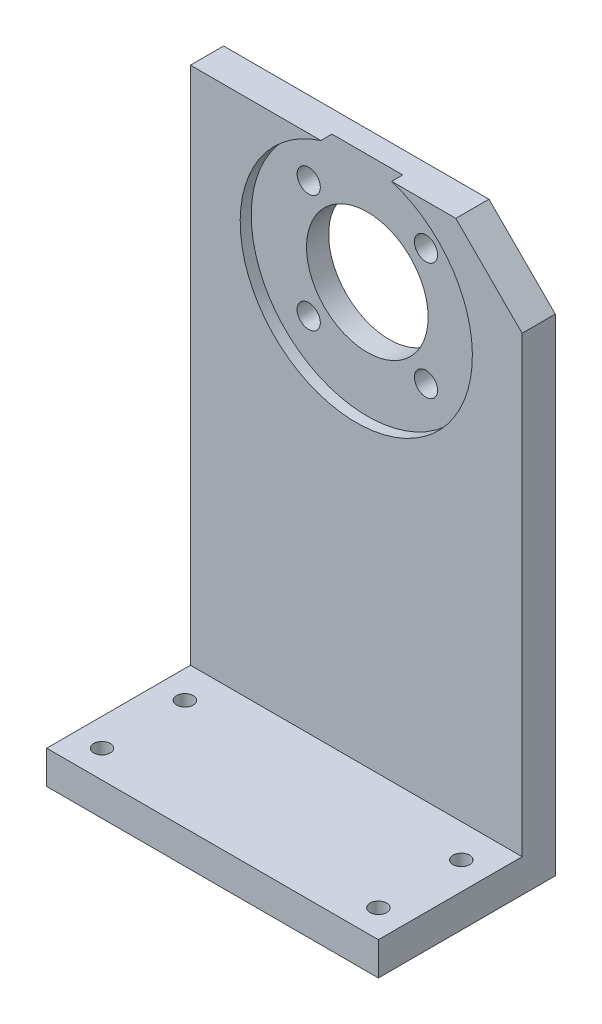
ISO-10303-21;
HEADER;
FILE_DESCRIPTION(('STEP AP214'),'2;1');
FILE_NAME('part.step','',(''),(''),'','','');
FILE_SCHEMA(('AUTOMOTIVE_DESIGN { 1 0 10303 214 1 1 1 1 }'));
ENDSEC;
DATA;
#1=APPLICATION_CONTEXT('core data for automotive mechanical design processes');
#2=APPLICATION_PROTOCOL_DEFINITION('international standard','automotive_design',2000,#1);
#3=PRODUCT_CONTEXT('',#1,'mechanical');
#4=PRODUCT('Part','Part','',(#3));
#5=PRODUCT_RELATED_PRODUCT_CATEGORY('part','',(#4));
#6=PRODUCT_DEFINITION_FORMATION('','',#4);
#7=PRODUCT_DEFINITION_CONTEXT('part definition',#1,'design');
#8=PRODUCT_DEFINITION('design','',#6,#7);
#9=PRODUCT_DEFINITION_SHAPE('','',#8);
#10=(LENGTH_UNIT() NAMED_UNIT(*) SI_UNIT(.MILLI.,.METRE.));
#11=(NAMED_UNIT(*) PLANE_ANGLE_UNIT() SI_UNIT($,.RADIAN.));
#12=(NAMED_UNIT(*) SI_UNIT($,.STERADIAN.) SOLID_ANGLE_UNIT());
#13=UNCERTAINTY_MEASURE_WITH_UNIT(LENGTH_MEASURE(1.E-05),#10,'distance_accuracy_value','');
#14=(GEOMETRIC_REPRESENTATION_CONTEXT(3) GLOBAL_UNCERTAINTY_ASSIGNED_CONTEXT((#13)) GLOBAL_UNIT_ASSIGNED_CONTEXT((#10,
#11,#12)) REPRESENTATION_CONTEXT('',''));
#15=CARTESIAN_POINT('',(0.,0.,0.));
#16=DIRECTION('',(0.,0.,1.));
#17=DIRECTION('',(1.,0.,0.));
#18=AXIS2_PLACEMENT_3D('',#15,#16,#17);
#19=CARTESIAN_POINT('',(225.596535273302,-222.754281735798,33.));
#20=DIRECTION('',(0.,0.,-1.));
#21=DIRECTION('',(-1.,0.,0.));
#22=AXIS2_PLACEMENT_3D('',#19,#20,#21);
#23=CYLINDRICAL_SURFACE('',#22,2.09999999999999);
#24=CARTESIAN_POINT('',(225.596535273302,-222.754281735798,23.8082903767918));
#25=DIRECTION('',(0.,0.,-1.));
#26=DIRECTION('',(1.,0.,0.));
#27=AXIS2_PLACEMENT_3D('',#24,#25,#26);
#28=CIRCLE('',#27,2.10000000000823);
#29=CARTESIAN_POINT('',(227.69653527331,-222.754281735798,23.8082903767918));
#30=VERTEX_POINT('',#29);
#31=EDGE_CURVE('E166',#30,#30,#28,.T.);
#32=ORIENTED_EDGE('',*,*,#31,.T.);
#33=EDGE_LOOP('',(#32));
#34=FACE_BOUND('',#33,.T.);
#35=CARTESIAN_POINT('',(225.596535273302,-222.754281735798,27.));
#36=DIRECTION('',(0.,0.,-1.));
#37=DIRECTION('',(-1.,0.,0.));
#38=AXIS2_PLACEMENT_3D('',#35,#36,#37);
#39=CIRCLE('',#38,2.09999999999999);
#40=CARTESIAN_POINT('',(223.496535273302,-222.754281735798,27.));
#41=VERTEX_POINT('',#40);
#42=EDGE_CURVE('E84',#41,#41,#39,.T.);
#43=ORIENTED_EDGE('',*,*,#42,.F.);
#44=EDGE_LOOP('',(#43));
#45=FACE_BOUND('',#44,.T.);
#46=ADVANCED_FACE('F17',(#34,#45),#23,.F.);
#47=CARTESIAN_POINT('',(246.809738708898,-201.541078300202,33.));
#48=DIRECTION('',(0.,0.,-1.));
#49=DIRECTION('',(-1.,0.,0.));
#50=AXIS2_PLACEMENT_3D('',#47,#48,#49);
#51=CYLINDRICAL_SURFACE('',#50,2.09999999999999);
#52=CARTESIAN_POINT('',(246.809738708898,-201.541078300202,27.));
#53=DIRECTION('',(0.,0.,-1.));
#54=DIRECTION('',(-1.,0.,0.));
#55=AXIS2_PLACEMENT_3D('',#52,#53,#54);
#56=CIRCLE('',#55,2.09999999999999);
#57=CARTESIAN_POINT('',(244.709738708898,-201.541078300202,27.));
#58=VERTEX_POINT('',#57);
#59=EDGE_CURVE('E205',#58,#58,#56,.T.);
#60=ORIENTED_EDGE('',*,*,#59,.F.);
#61=EDGE_LOOP('',(#60));
#62=FACE_BOUND('',#61,.T.);
#63=CARTESIAN_POINT('',(246.809738708898,-201.541078300202,23.8082903768486));
#64=DIRECTION('',(0.,0.,-1.));
#65=DIRECTION('',(-1.,0.,0.));
#66=AXIS2_PLACEMENT_3D('',#63,#64,#65);
#67=CIRCLE('',#66,2.09999999996388);
#68=CARTESIAN_POINT('',(244.709738708934,-201.541078300202,23.8082903768486));
#69=VERTEX_POINT('',#68);
#70=EDGE_CURVE('E163',#69,#69,#67,.T.);
#71=ORIENTED_EDGE('',*,*,#70,.T.);
#72=EDGE_LOOP('',(#71));
#73=FACE_BOUND('',#72,.T.);
#74=ADVANCED_FACE('F226',(#62,#73),#51,.F.);
#75=CARTESIAN_POINT('',(211.2030482675,-297.147680018,50.));
#76=DIRECTION('',(0.,1.,0.));
#77=DIRECTION('',(0.,0.,1.));
#78=AXIS2_PLACEMENT_3D('',#75,#76,#77);
#79=CYLINDRICAL_SURFACE('',#78,1.50000000000003);
#80=CARTESIAN_POINT('',(211.2030482675,-292.147680018,50.));
#81=DIRECTION('',(0.,1.,0.));
#82=DIRECTION('',(0.,0.,1.));
#83=AXIS2_PLACEMENT_3D('',#80,#81,#82);
#84=CIRCLE('',#83,1.50000000000003);
#85=CARTESIAN_POINT('',(211.2030482675,-292.147680018,51.5));
#86=VERTEX_POINT('',#85);
#87=EDGE_CURVE('E193',#86,#86,#84,.T.);
#88=ORIENTED_EDGE('',*,*,#87,.F.);
#89=EDGE_LOOP('',(#88));
#90=FACE_BOUND('',#89,.T.);
#91=CARTESIAN_POINT('',(211.2030482675,-286.147680018,50.));
#92=DIRECTION('',(0.,1.,0.));
#93=DIRECTION('',(0.,0.,1.));
#94=AXIS2_PLACEMENT_3D('',#91,#92,#93);
#95=CIRCLE('',#94,1.50000000000003);
#96=CARTESIAN_POINT('',(211.2030482675,-286.147680018,51.5));
#97=VERTEX_POINT('',#96);
#98=EDGE_CURVE('E20',#97,#97,#95,.F.);
#99=ORIENTED_EDGE('',*,*,#98,.F.);
#100=EDGE_LOOP('',(#99));
#101=FACE_BOUND('',#100,.T.);
#102=ADVANCED_FACE('F223',(#90,#101),#79,.F.);
#103=CARTESIAN_POINT('',(211.2030482675,-297.147680018,35.));
#104=DIRECTION('',(0.,1.,0.));
#105=DIRECTION('',(0.,0.,1.));
#106=AXIS2_PLACEMENT_3D('',#103,#104,#105);
#107=CYLINDRICAL_SURFACE('',#106,1.50000000000003);
#108=CARTESIAN_POINT('',(211.2030482675,-292.147680018,35.));
#109=DIRECTION('',(0.,1.,0.));
#110=DIRECTION('',(0.,0.,1.));
#111=AXIS2_PLACEMENT_3D('',#108,#109,#110);
#112=CIRCLE('',#111,1.50000000000003);
#113=CARTESIAN_POINT('',(211.2030482675,-292.147680018,36.5));
#114=VERTEX_POINT('',#113);
#115=EDGE_CURVE('E190',#114,#114,#112,.T.);
#116=ORIENTED_EDGE('',*,*,#115,.F.);
#117=EDGE_LOOP('',(#116));
#118=FACE_BOUND('',#117,.T.);
#119=CARTESIAN_POINT('',(211.2030482675,-286.147680018,35.));
#120=DIRECTION('',(0.,1.,0.));
#121=DIRECTION('',(0.,0.,1.));
#122=AXIS2_PLACEMENT_3D('',#119,#120,#121);
#123=CIRCLE('',#122,1.50000000000003);
#124=CARTESIAN_POINT('',(211.2030482675,-286.147680018,36.5));
#125=VERTEX_POINT('',#124);
#126=EDGE_CURVE('E212',#125,#125,#123,.F.);
#127=ORIENTED_EDGE('',*,*,#126,.F.);
#128=EDGE_LOOP('',(#127));
#129=FACE_BOUND('',#128,.T.);
#130=ADVANCED_FACE('F225',(#118,#129),#107,.F.);
#131=CARTESIAN_POINT('',(261.2030482675,-297.147680018,35.));
#132=DIRECTION('',(0.,1.,0.));
#133=DIRECTION('',(0.,0.,1.));
#134=AXIS2_PLACEMENT_3D('',#131,#132,#133);
#135=CYLINDRICAL_SURFACE('',#134,1.50000000000002);
#136=CARTESIAN_POINT('',(261.2030482675,-292.147680018,35.));
#137=DIRECTION('',(0.,1.,0.));
#138=DIRECTION('',(0.,0.,1.));
#139=AXIS2_PLACEMENT_3D('',#136,#137,#138);
#140=CIRCLE('',#139,1.50000000000002);
#141=CARTESIAN_POINT('',(261.2030482675,-292.147680018,36.5));
#142=VERTEX_POINT('',#141);
#143=EDGE_CURVE('E187',#142,#142,#140,.T.);
#144=ORIENTED_EDGE('',*,*,#143,.F.);
#145=EDGE_LOOP('',(#144));
#146=FACE_BOUND('',#145,.T.);
#147=CARTESIAN_POINT('',(261.2030482675,-286.147680018,35.));
#148=DIRECTION('',(0.,1.,0.));
#149=DIRECTION('',(0.,0.,1.));
#150=AXIS2_PLACEMENT_3D('',#147,#148,#149);
#151=CIRCLE('',#150,1.50000000000002);
#152=CARTESIAN_POINT('',(261.2030482675,-286.147680018,36.5));
#153=VERTEX_POINT('',#152);
#154=EDGE_CURVE('E214',#153,#153,#151,.F.);
#155=ORIENTED_EDGE('',*,*,#154,.F.);
#156=EDGE_LOOP('',(#155));
#157=FACE_BOUND('',#156,.T.);
#158=ADVANCED_FACE('F234',(#146,#157),#135,.F.);
#159=CARTESIAN_POINT('',(261.2030482675,-297.147680018,50.));
#160=DIRECTION('',(0.,1.,0.));
#161=DIRECTION('',(0.,0.,1.));
#162=AXIS2_PLACEMENT_3D('',#159,#160,#161);
#163=CYLINDRICAL_SURFACE('',#162,1.50000000000002);
#164=CARTESIAN_POINT('',(261.2030482675,-292.147680018,50.));
#165=DIRECTION('',(0.,1.,0.));
#166=DIRECTION('',(0.,0.,1.));
#167=AXIS2_PLACEMENT_3D('',#164,#165,#166);
#168=CIRCLE('',#167,1.50000000000002);
#169=CARTESIAN_POINT('',(261.2030482675,-292.147680018,51.5));
#170=VERTEX_POINT('',#169);
#171=EDGE_CURVE('E183',#170,#170,#168,.T.);
#172=ORIENTED_EDGE('',*,*,#171,.F.);
#173=EDGE_LOOP('',(#172));
#174=FACE_BOUND('',#173,.T.);
#175=CARTESIAN_POINT('',(261.2030482675,-286.147680018,50.));
#176=DIRECTION('',(0.,1.,0.));
#177=DIRECTION('',(0.,0.,1.));
#178=AXIS2_PLACEMENT_3D('',#175,#176,#177);
#179=CIRCLE('',#178,1.50000000000002);
#180=CARTESIAN_POINT('',(261.2030482675,-286.147680018,51.5));
#181=VERTEX_POINT('',#180);
#182=EDGE_CURVE('E149',#181,#181,#179,.F.);
#183=ORIENTED_EDGE('',*,*,#182,.F.);
#184=EDGE_LOOP('',(#183));
#185=FACE_BOUND('',#184,.T.);
#186=ADVANCED_FACE('F308',(#174,#185),#163,.F.);
#187=CARTESIAN_POINT('',(0.,-286.147680018,0.));
#188=DIRECTION('',(0.,1.,0.));
#189=DIRECTION('',(0.,0.,1.));
#190=AXIS2_PLACEMENT_3D('',#187,#188,#189);
#191=PLANE('',#190);
#192=ORIENTED_EDGE('',*,*,#182,.T.);
#193=EDGE_LOOP('',(#192));
#194=FACE_BOUND('',#193,.T.);
#195=ORIENTED_EDGE('',*,*,#126,.T.);
#196=EDGE_LOOP('',(#195));
#197=FACE_BOUND('',#196,.T.);
#198=DIRECTION('',(0.,0.,-1.));
#199=VECTOR('',#198,1.);
#200=CARTESIAN_POINT('',(206.2030482675,-286.147680018,23.));
#201=LINE('',#200,#199);
#202=CARTESIAN_POINT('',(206.2030482675,-286.147680018,29.));
#203=VERTEX_POINT('',#202);
#204=CARTESIAN_POINT('',(206.2030482675,-286.147680018,55.));
#205=VERTEX_POINT('',#204);
#206=EDGE_CURVE('E132',#203,#205,#201,.F.);
#207=ORIENTED_EDGE('',*,*,#206,.T.);
#208=DIRECTION('',(1.,0.,0.));
#209=VECTOR('',#208,1.);
#210=CARTESIAN_POINT('',(0.,-286.147680018,55.));
#211=LINE('',#210,#209);
#212=CARTESIAN_POINT('',(266.2030482675,-286.147680018,55.));
#213=VERTEX_POINT('',#212);
#214=EDGE_CURVE('E146',#213,#205,#211,.F.);
#215=ORIENTED_EDGE('',*,*,#214,.F.);
#216=DIRECTION('',(0.,0.,-1.));
#217=VECTOR('',#216,1.);
#218=CARTESIAN_POINT('',(266.2030482675,-286.147680018,23.));
#219=LINE('',#218,#217);
#220=CARTESIAN_POINT('',(266.2030482675,-286.147680018,29.));
#221=VERTEX_POINT('',#220);
#222=EDGE_CURVE('E139',#221,#213,#219,.F.);
#223=ORIENTED_EDGE('',*,*,#222,.F.);
#224=DIRECTION('',(1.,0.,0.));
#225=VECTOR('',#224,1.);
#226=CARTESIAN_POINT('',(242.8749133092,-286.147680018,29.));
#227=LINE('',#226,#225);
#228=EDGE_CURVE('E85',#203,#221,#227,.T.);
#229=ORIENTED_EDGE('',*,*,#228,.F.);
#230=EDGE_LOOP('',(#207,#215,#223,#229));
#231=FACE_BOUND('',#230,.T.);
#232=ORIENTED_EDGE('',*,*,#154,.T.);
#233=EDGE_LOOP('',(#232));
#234=FACE_BOUND('',#233,.T.);
#235=ORIENTED_EDGE('',*,*,#98,.T.);
#236=EDGE_LOOP('',(#235));
#237=FACE_BOUND('',#236,.T.);
#238=ADVANCED_FACE('F221',(#194,#197,#231,#234,#237),#191,.T.);
#239=CARTESIAN_POINT('',(0.,0.,55.));
#240=DIRECTION('',(0.,0.,1.));
#241=DIRECTION('',(1.,0.,0.));
#242=AXIS2_PLACEMENT_3D('',#239,#240,#241);
#243=PLANE('',#242);
#244=ORIENTED_EDGE('',*,*,#214,.T.);
#245=DIRECTION('',(0.,1.,0.));
#246=VECTOR('',#245,1.);
#247=CARTESIAN_POINT('',(206.2030482675,-292.147680018,55.));
#248=LINE('',#247,#246);
#249=CARTESIAN_POINT('',(206.2030482675,-292.147680018,55.));
#250=VERTEX_POINT('',#249);
#251=EDGE_CURVE('E160',#205,#250,#248,.F.);
#252=ORIENTED_EDGE('',*,*,#251,.T.);
#253=DIRECTION('',(1.,0.,0.));
#254=VECTOR('',#253,1.);
#255=CARTESIAN_POINT('',(207.616141789,-292.147680018,55.));
#256=LINE('',#255,#254);
#257=CARTESIAN_POINT('',(266.2030482675,-292.147680018,55.));
#258=VERTEX_POINT('',#257);
#259=EDGE_CURVE('E186',#258,#250,#256,.F.);
#260=ORIENTED_EDGE('',*,*,#259,.F.);
#261=DIRECTION('',(0.,1.,0.));
#262=VECTOR('',#261,1.);
#263=CARTESIAN_POINT('',(266.2030482675,-292.147680018,55.));
#264=LINE('',#263,#262);
#265=EDGE_CURVE('E155',#213,#258,#264,.F.);
#266=ORIENTED_EDGE('',*,*,#265,.F.);
#267=EDGE_LOOP('',(#244,#252,#260,#266));
#268=FACE_BOUND('',#267,.T.);
#269=ADVANCED_FACE('F302',(#268),#243,.T.);
#270=CARTESIAN_POINT('',(242.8749133092,-210.7827941645,29.));
#271=DIRECTION('',(0.,0.,1.));
#272=DIRECTION('',(1.,0.,0.));
#273=AXIS2_PLACEMENT_3D('',#270,#271,#272);
#274=PLANE('',#273);
#275=CARTESIAN_POINT('',(236.2031369911,-212.147680018,29.));
#276=DIRECTION('',(0.,0.,1.));
#277=DIRECTION('',(1.,0.,0.));
#278=AXIS2_PLACEMENT_3D('',#275,#276,#277);
#279=CIRCLE('',#278,21.);
#280=CARTESIAN_POINT('',(242.606261228533,-192.147680018,29.));
#281=VERTEX_POINT('',#280);
#282=CARTESIAN_POINT('',(229.800012753667,-192.147680018,29.));
#283=VERTEX_POINT('',#282);
#284=EDGE_CURVE('E74',#281,#283,#279,.F.);
#285=ORIENTED_EDGE('',*,*,#284,.T.);
#286=DIRECTION('',(1.,0.,0.));
#287=VECTOR('',#286,1.);
#288=CARTESIAN_POINT('',(219.4648613036,-192.147680018,29.));
#289=LINE('',#288,#287);
#290=CARTESIAN_POINT('',(206.2030482675,-192.147680018,29.));
#291=VERTEX_POINT('',#290);
#292=EDGE_CURVE('E121',#283,#291,#289,.F.);
#293=ORIENTED_EDGE('',*,*,#292,.T.);
#294=DIRECTION('',(0.,1.,0.));
#295=VECTOR('',#294,1.);
#296=CARTESIAN_POINT('',(206.2030482675,-292.147680018,29.));
#297=LINE('',#296,#295);
#298=EDGE_CURVE('E129',#291,#203,#297,.F.);
#299=ORIENTED_EDGE('',*,*,#298,.T.);
#300=ORIENTED_EDGE('',*,*,#228,.T.);
#301=DIRECTION('',(0.,1.,0.));
#302=VECTOR('',#301,1.);
#303=CARTESIAN_POINT('',(266.2030482675,-292.147680018,29.));
#304=LINE('',#303,#302);
#305=CARTESIAN_POINT('',(266.203048267483,-204.147680018004,29.));
#306=VERTEX_POINT('',#305);
#307=EDGE_CURVE('E136',#306,#221,#304,.F.);
#308=ORIENTED_EDGE('',*,*,#307,.F.);
#309=DIRECTION('',(-0.707106781186547,0.707106781186548,0.));
#310=VECTOR('',#309,1.);
#311=CARTESIAN_POINT('',(254.203048267471,-192.147680018,29.));
#312=LINE('',#311,#310);
#313=CARTESIAN_POINT('',(254.203048267471,-192.147680018,29.));
#314=VERTEX_POINT('',#313);
#315=EDGE_CURVE('E95',#314,#306,#312,.F.);
#316=ORIENTED_EDGE('',*,*,#315,.F.);
#317=DIRECTION('',(1.,0.,0.));
#318=VECTOR('',#317,1.);
#319=CARTESIAN_POINT('',(219.4648613036,-192.147680018,29.));
#320=LINE('',#319,#318);
#321=EDGE_CURVE('E89',#314,#281,#320,.F.);
#322=ORIENTED_EDGE('',*,*,#321,.T.);
#323=EDGE_LOOP('',(#285,#293,#299,#300,#308,#316,#322));
#324=FACE_BOUND('',#323,.T.);
#325=ADVANCED_FACE('F93',(#324),#274,.T.);
#326=CARTESIAN_POINT('',(236.2031369911,-212.147680018,27.));
#327=DIRECTION('',(0.,0.,1.));
#328=DIRECTION('',(1.,0.,0.));
#329=AXIS2_PLACEMENT_3D('',#326,#327,#328);
#330=CYLINDRICAL_SURFACE('',#329,21.);
#331=CARTESIAN_POINT('',(236.2031369911,-212.147680018,27.));
#332=DIRECTION('',(0.,0.,1.));
#333=DIRECTION('',(1.,0.,0.));
#334=AXIS2_PLACEMENT_3D('',#331,#332,#333);
#335=CIRCLE('',#334,21.);
#336=CARTESIAN_POINT('',(229.800012753667,-192.147680018,27.));
#337=VERTEX_POINT('',#336);
#338=CARTESIAN_POINT('',(242.606261228533,-192.147680018,27.));
#339=VERTEX_POINT('',#338);
#340=EDGE_CURVE('E203',#337,#339,#335,.T.);
#341=ORIENTED_EDGE('',*,*,#340,.F.);
#342=DIRECTION('',(0.,0.,-1.));
#343=VECTOR('',#342,1.);
#344=CARTESIAN_POINT('',(229.800012753667,-192.147680018,18.));
#345=LINE('',#344,#343);
#346=EDGE_CURVE('E79',#337,#283,#345,.F.);
#347=ORIENTED_EDGE('',*,*,#346,.T.);
#348=ORIENTED_EDGE('',*,*,#284,.F.);
#349=DIRECTION('',(0.,0.,-1.));
#350=VECTOR('',#349,1.);
#351=CARTESIAN_POINT('',(242.606261228533,-192.147680018,18.));
#352=LINE('',#351,#350);
#353=EDGE_CURVE('E77',#281,#339,#352,.T.);
#354=ORIENTED_EDGE('',*,*,#353,.T.);
#355=EDGE_LOOP('',(#341,#347,#348,#354));
#356=FACE_BOUND('',#355,.T.);
#357=ADVANCED_FACE('F76',(#356),#330,.F.);
#358=CARTESIAN_POINT('',(236.2031369911,-212.147680018,27.));
#359=DIRECTION('',(0.,0.,1.));
#360=DIRECTION('',(1.,0.,0.));
#361=AXIS2_PLACEMENT_3D('',#358,#359,#360);
#362=PLANE('',#361);
#363=CARTESIAN_POINT('',(246.809738708898,-222.754281735798,27.));
#364=DIRECTION('',(0.,0.,-1.));
#365=DIRECTION('',(-1.,0.,0.));
#366=AXIS2_PLACEMENT_3D('',#363,#364,#365);
#367=CIRCLE('',#366,2.09999999999999);
#368=CARTESIAN_POINT('',(244.709738708898,-222.754281735798,27.));
#369=VERTEX_POINT('',#368);
#370=EDGE_CURVE('E168',#369,#369,#367,.T.);
#371=ORIENTED_EDGE('',*,*,#370,.T.);
#372=EDGE_LOOP('',(#371));
#373=FACE_BOUND('',#372,.T.);
#374=CARTESIAN_POINT('',(225.596535273302,-201.541078300202,27.));
#375=DIRECTION('',(0.,0.,-1.));
#376=DIRECTION('',(-1.,0.,0.));
#377=AXIS2_PLACEMENT_3D('',#374,#375,#376);
#378=CIRCLE('',#377,2.09999999999999);
#379=CARTESIAN_POINT('',(223.496535273302,-201.541078300202,27.));
#380=VERTEX_POINT('',#379);
#381=EDGE_CURVE('E200',#380,#380,#378,.T.);
#382=ORIENTED_EDGE('',*,*,#381,.T.);
#383=EDGE_LOOP('',(#382));
#384=FACE_BOUND('',#383,.T.);
#385=CARTESIAN_POINT('',(236.2031369911,-212.147680018,27.));
#386=DIRECTION('',(0.,0.,1.));
#387=DIRECTION('',(1.,0.,0.));
#388=AXIS2_PLACEMENT_3D('',#385,#386,#387);
#389=CIRCLE('',#388,11.);
#390=CARTESIAN_POINT('',(247.2031369911,-212.147680018,27.));
#391=VERTEX_POINT('',#390);
#392=EDGE_CURVE('E133',#391,#391,#389,.F.);
#393=ORIENTED_EDGE('',*,*,#392,.T.);
#394=EDGE_LOOP('',(#393));
#395=FACE_BOUND('',#394,.T.);
#396=DIRECTION('',(1.,0.,0.));
#397=VECTOR('',#396,1.);
#398=CARTESIAN_POINT('',(219.4648613036,-192.147680018,27.));
#399=LINE('',#398,#397);
#400=EDGE_CURVE('E91',#339,#337,#399,.F.);
#401=ORIENTED_EDGE('',*,*,#400,.T.);
#402=ORIENTED_EDGE('',*,*,#340,.T.);
#403=EDGE_LOOP('',(#401,#402));
#404=FACE_BOUND('',#403,.T.);
#405=ORIENTED_EDGE('',*,*,#59,.T.);
#406=EDGE_LOOP('',(#405));
#407=FACE_BOUND('',#406,.T.);
#408=ORIENTED_EDGE('',*,*,#42,.T.);
#409=EDGE_LOOP('',(#408));
#410=FACE_BOUND('',#409,.T.);
#411=ADVANCED_FACE('F293',(#373,#384,#395,#404,#407,#410),#362,.T.);
#412=CARTESIAN_POINT('',(225.596535273302,-201.541078300202,33.));
#413=DIRECTION('',(0.,0.,-1.));
#414=DIRECTION('',(-1.,0.,0.));
#415=AXIS2_PLACEMENT_3D('',#412,#413,#414);
#416=CYLINDRICAL_SURFACE('',#415,2.09999999999999);
#417=ORIENTED_EDGE('',*,*,#381,.F.);
#418=EDGE_LOOP('',(#417));
#419=FACE_BOUND('',#418,.T.);
#420=CARTESIAN_POINT('',(225.596535273302,-201.541078300202,23.8082903768486));
#421=DIRECTION('',(0.,0.,-1.));
#422=DIRECTION('',(0.,-1.,0.));
#423=AXIS2_PLACEMENT_3D('',#420,#421,#422);
#424=CIRCLE('',#423,2.10000000002061);
#425=CARTESIAN_POINT('',(225.596535273302,-203.641078300222,23.8082903768486));
#426=VERTEX_POINT('',#425);
#427=EDGE_CURVE('E361',#426,#426,#424,.T.);
#428=ORIENTED_EDGE('',*,*,#427,.T.);
#429=EDGE_LOOP('',(#428));
#430=FACE_BOUND('',#429,.T.);
#431=ADVANCED_FACE('F289',(#419,#430),#416,.F.);
#432=CARTESIAN_POINT('',(246.809738708898,-222.754281735798,33.));
#433=DIRECTION('',(0.,0.,-1.));
#434=DIRECTION('',(-1.,0.,0.));
#435=AXIS2_PLACEMENT_3D('',#432,#433,#434);
#436=CYLINDRICAL_SURFACE('',#435,2.09999999999999);
#437=CARTESIAN_POINT('',(246.809738708898,-222.754281735798,23.8082903768486));
#438=DIRECTION('',(0.,0.,-1.));
#439=DIRECTION('',(0.,1.,0.));
#440=AXIS2_PLACEMENT_3D('',#437,#438,#439);
#441=CIRCLE('',#440,2.10000000000815);
#442=CARTESIAN_POINT('',(246.809738708898,-220.65428173579,23.8082903768486));
#443=VERTEX_POINT('',#442);
#444=EDGE_CURVE('E182',#443,#443,#441,.T.);
#445=ORIENTED_EDGE('',*,*,#444,.T.);
#446=EDGE_LOOP('',(#445));
#447=FACE_BOUND('',#446,.T.);
#448=ORIENTED_EDGE('',*,*,#370,.F.);
#449=EDGE_LOOP('',(#448));
#450=FACE_BOUND('',#449,.T.);
#451=ADVANCED_FACE('F285',(#447,#450),#436,.F.);
#452=CARTESIAN_POINT('',(225.596535273302,-222.754281735798,23.0000000000814));
#453=DIRECTION('',(0.,0.,-1.));
#454=DIRECTION('',(-1.,0.,0.));
#455=AXIS2_PLACEMENT_3D('',#452,#453,#454);
#456=CONICAL_SURFACE('',#455,3.49999999977049,1.047197551198);
#457=ORIENTED_EDGE('',*,*,#31,.F.);
#458=EDGE_LOOP('',(#457));
#459=FACE_BOUND('',#458,.T.);
#460=CARTESIAN_POINT('',(225.596535273302,-222.754281735798,22.9999999999967));
#461=DIRECTION('',(0.,0.,-1.));
#462=DIRECTION('',(-1.,0.,0.));
#463=AXIS2_PLACEMENT_3D('',#460,#461,#462);
#464=CIRCLE('',#463,3.49999999991724);
#465=CARTESIAN_POINT('',(222.096535273385,-222.754281735798,22.9999999999967));
#466=VERTEX_POINT('',#465);
#467=EDGE_CURVE('E179',#466,#466,#464,.T.);
#468=ORIENTED_EDGE('',*,*,#467,.T.);
#469=EDGE_LOOP('',(#468));
#470=FACE_BOUND('',#469,.T.);
#471=ADVANCED_FACE('F281',(#459,#470),#456,.F.);
#472=CARTESIAN_POINT('',(246.809738708898,-201.541078300202,23.0000000000814));
#473=DIRECTION('',(0.,0.,-1.));
#474=DIRECTION('',(-1.,0.,0.));
#475=AXIS2_PLACEMENT_3D('',#472,#473,#474);
#476=CONICAL_SURFACE('',#475,3.49999999983983,1.04719755120742);
#477=ORIENTED_EDGE('',*,*,#70,.F.);
#478=EDGE_LOOP('',(#477));
#479=FACE_BOUND('',#478,.T.);
#480=CARTESIAN_POINT('',(246.809738708898,-201.541078300202,22.9999999999711));
#481=DIRECTION('',(0.,0.,-1.));
#482=DIRECTION('',(-1.,0.,0.));
#483=AXIS2_PLACEMENT_3D('',#480,#481,#482);
#484=CIRCLE('',#483,3.50000000003092);
#485=CARTESIAN_POINT('',(243.309738708867,-201.541078300202,22.9999999999711));
#486=VERTEX_POINT('',#485);
#487=EDGE_CURVE('E176',#486,#486,#484,.T.);
#488=ORIENTED_EDGE('',*,*,#487,.T.);
#489=EDGE_LOOP('',(#488));
#490=FACE_BOUND('',#489,.T.);
#491=ADVANCED_FACE('F277',(#479,#490),#476,.F.);
#492=CARTESIAN_POINT('',(236.2031369911,-212.147680018,18.));
#493=DIRECTION('',(0.,0.,1.));
#494=DIRECTION('',(1.,0.,0.));
#495=AXIS2_PLACEMENT_3D('',#492,#493,#494);
#496=CYLINDRICAL_SURFACE('',#495,11.);
#497=CARTESIAN_POINT('',(236.2031369911,-212.147680018,23.));
#498=DIRECTION('',(0.,0.,1.));
#499=DIRECTION('',(1.,0.,0.));
#500=AXIS2_PLACEMENT_3D('',#497,#498,#499);
#501=CIRCLE('',#500,11.);
#502=CARTESIAN_POINT('',(247.2031369911,-212.147680018,23.));
#503=VERTEX_POINT('',#502);
#504=EDGE_CURVE('E172',#503,#503,#501,.F.);
#505=ORIENTED_EDGE('',*,*,#504,.T.);
#506=EDGE_LOOP('',(#505));
#507=FACE_BOUND('',#506,.T.);
#508=ORIENTED_EDGE('',*,*,#392,.F.);
#509=EDGE_LOOP('',(#508));
#510=FACE_BOUND('',#509,.T.);
#511=ADVANCED_FACE('F273',(#507,#510),#496,.F.);
#512=CARTESIAN_POINT('',(206.2030482675,-292.147680018,23.));
#513=DIRECTION('',(1.,0.,0.));
#514=DIRECTION('',(0.,0.,-1.));
#515=AXIS2_PLACEMENT_3D('',#512,#513,#514);
#516=PLANE('',#515);
#517=ORIENTED_EDGE('',*,*,#206,.F.);
#518=ORIENTED_EDGE('',*,*,#298,.F.);
#519=DIRECTION('',(0.,0.,-1.));
#520=VECTOR('',#519,1.);
#521=CARTESIAN_POINT('',(206.2030482675,-192.147680018,18.));
#522=LINE('',#521,#520);
#523=CARTESIAN_POINT('',(206.2030482675,-192.147680018,23.));
#524=VERTEX_POINT('',#523);
#525=EDGE_CURVE('E97',#291,#524,#522,.T.);
#526=ORIENTED_EDGE('',*,*,#525,.T.);
#527=DIRECTION('',(0.,1.,0.));
#528=VECTOR('',#527,1.);
#529=CARTESIAN_POINT('',(206.2030482675,0.,23.));
#530=LINE('',#529,#528);
#531=CARTESIAN_POINT('',(206.2030482675,-292.147680018,23.));
#532=VERTEX_POINT('',#531);
#533=EDGE_CURVE('E175',#524,#532,#530,.F.);
#534=ORIENTED_EDGE('',*,*,#533,.T.);
#535=DIRECTION('',(0.,0.,-1.));
#536=VECTOR('',#535,1.);
#537=CARTESIAN_POINT('',(206.2030482675,-292.147680018,23.));
#538=LINE('',#537,#536);
#539=EDGE_CURVE('E140',#250,#532,#538,.T.);
#540=ORIENTED_EDGE('',*,*,#539,.F.);
#541=ORIENTED_EDGE('',*,*,#251,.F.);
#542=EDGE_LOOP('',(#517,#518,#526,#534,#540,#541));
#543=FACE_BOUND('',#542,.T.);
#544=ADVANCED_FACE('F269',(#543),#516,.F.);
#545=CARTESIAN_POINT('',(207.616141789,-292.147680018,23.));
#546=DIRECTION('',(0.,-1.,0.));
#547=DIRECTION('',(0.,0.,-1.));
#548=AXIS2_PLACEMENT_3D('',#545,#546,#547);
#549=PLANE('',#548);
#550=ORIENTED_EDGE('',*,*,#259,.T.);
#551=ORIENTED_EDGE('',*,*,#539,.T.);
#552=DIRECTION('',(1.,0.,0.));
#553=VECTOR('',#552,1.);
#554=CARTESIAN_POINT('',(0.,-292.147680018,23.));
#555=LINE('',#554,#553);
#556=CARTESIAN_POINT('',(266.2030482675,-292.147680018,23.));
#557=VERTEX_POINT('',#556);
#558=EDGE_CURVE('E538',#532,#557,#555,.T.);
#559=ORIENTED_EDGE('',*,*,#558,.T.);
#560=DIRECTION('',(0.,0.,-1.));
#561=VECTOR('',#560,1.);
#562=CARTESIAN_POINT('',(266.2030482675,-292.147680018,23.));
#563=LINE('',#562,#561);
#564=EDGE_CURVE('E108',#258,#557,#563,.T.);
#565=ORIENTED_EDGE('',*,*,#564,.F.);
#566=EDGE_LOOP('',(#550,#551,#559,#565));
#567=FACE_BOUND('',#566,.T.);
#568=ORIENTED_EDGE('',*,*,#171,.T.);
#569=EDGE_LOOP('',(#568));
#570=FACE_BOUND('',#569,.T.);
#571=ORIENTED_EDGE('',*,*,#143,.T.);
#572=EDGE_LOOP('',(#571));
#573=FACE_BOUND('',#572,.T.);
#574=ORIENTED_EDGE('',*,*,#115,.T.);
#575=EDGE_LOOP('',(#574));
#576=FACE_BOUND('',#575,.T.);
#577=ORIENTED_EDGE('',*,*,#87,.T.);
#578=EDGE_LOOP('',(#577));
#579=FACE_BOUND('',#578,.T.);
#580=ADVANCED_FACE('F265',(#567,#570,#573,#576,#579),#549,.T.);
#581=CARTESIAN_POINT('',(266.2030482675,-292.147680018,23.));
#582=DIRECTION('',(1.,0.,0.));
#583=DIRECTION('',(0.,0.,-1.));
#584=AXIS2_PLACEMENT_3D('',#581,#582,#583);
#585=PLANE('',#584);
#586=ORIENTED_EDGE('',*,*,#265,.T.);
#587=ORIENTED_EDGE('',*,*,#564,.T.);
#588=DIRECTION('',(0.,1.,0.));
#589=VECTOR('',#588,1.);
#590=CARTESIAN_POINT('',(266.2030482675,0.,23.));
#591=LINE('',#590,#589);
#592=CARTESIAN_POINT('',(266.203048267494,-204.147680018023,23.));
#593=VERTEX_POINT('',#592);
#594=EDGE_CURVE('E118',#557,#593,#591,.T.);
#595=ORIENTED_EDGE('',*,*,#594,.T.);
#596=DIRECTION('',(0.,0.,1.));
#597=VECTOR('',#596,1.);
#598=CARTESIAN_POINT('',(266.203048267474,-204.147680018004,18.));
#599=LINE('',#598,#597);
#600=EDGE_CURVE('E107',#306,#593,#599,.F.);
#601=ORIENTED_EDGE('',*,*,#600,.F.);
#602=ORIENTED_EDGE('',*,*,#307,.T.);
#603=ORIENTED_EDGE('',*,*,#222,.T.);
#604=EDGE_LOOP('',(#586,#587,#595,#601,#602,#603));
#605=FACE_BOUND('',#604,.T.);
#606=ADVANCED_FACE('F261',(#605),#585,.T.);
#607=CARTESIAN_POINT('',(254.203048267471,-192.147680018,18.));
#608=DIRECTION('',(0.707106781186548,0.707106781186547,0.));
#609=DIRECTION('',(-0.707106781186547,0.707106781186548,0.));
#610=AXIS2_PLACEMENT_3D('',#607,#608,#609);
#611=PLANE('',#610);
#612=DIRECTION('',(-0.707106781186548,0.707106781186548,0.));
#613=VECTOR('',#612,1.);
#614=CARTESIAN_POINT('',(266.2030482675,-204.147680018029,23.));
#615=LINE('',#614,#613);
#616=CARTESIAN_POINT('',(254.203048267471,-192.147680018,23.));
#617=VERTEX_POINT('',#616);
#618=EDGE_CURVE('E113',#593,#617,#615,.T.);
#619=ORIENTED_EDGE('',*,*,#618,.T.);
#620=DIRECTION('',(0.,0.,-1.));
#621=VECTOR('',#620,1.);
#622=CARTESIAN_POINT('',(254.203048267471,-192.147680018,18.));
#623=LINE('',#622,#621);
#624=EDGE_CURVE('E35',#617,#314,#623,.F.);
#625=ORIENTED_EDGE('',*,*,#624,.T.);
#626=ORIENTED_EDGE('',*,*,#315,.T.);
#627=ORIENTED_EDGE('',*,*,#600,.T.);
#628=EDGE_LOOP('',(#619,#625,#626,#627));
#629=FACE_BOUND('',#628,.T.);
#630=ADVANCED_FACE('F258',(#629),#611,.T.);
#631=CARTESIAN_POINT('',(219.4648613036,-192.147680018,18.));
#632=DIRECTION('',(0.,-1.,0.));
#633=DIRECTION('',(0.,0.,-1.));
#634=AXIS2_PLACEMENT_3D('',#631,#632,#633);
#635=PLANE('',#634);
#636=ORIENTED_EDGE('',*,*,#353,.F.);
#637=ORIENTED_EDGE('',*,*,#321,.F.);
#638=ORIENTED_EDGE('',*,*,#624,.F.);
#639=DIRECTION('',(1.,0.,0.));
#640=VECTOR('',#639,1.);
#641=CARTESIAN_POINT('',(0.,-192.147680018,23.));
#642=LINE('',#641,#640);
#643=EDGE_CURVE('E111',#617,#524,#642,.F.);
#644=ORIENTED_EDGE('',*,*,#643,.T.);
#645=ORIENTED_EDGE('',*,*,#525,.F.);
#646=ORIENTED_EDGE('',*,*,#292,.F.);
#647=ORIENTED_EDGE('',*,*,#346,.F.);
#648=ORIENTED_EDGE('',*,*,#400,.F.);
#649=EDGE_LOOP('',(#636,#637,#638,#644,#645,#646,#647,#648));
#650=FACE_BOUND('',#649,.T.);
#651=ADVANCED_FACE('F88',(#650),#635,.F.);
#652=CARTESIAN_POINT('',(225.596535273302,-201.541078300202,23.0000000001382));
#653=DIRECTION('',(0.,0.,-1.));
#654=DIRECTION('',(-1.,0.,0.));
#655=AXIS2_PLACEMENT_3D('',#652,#653,#654);
#656=CONICAL_SURFACE('',#655,3.49999999972603,1.047197551198);
#657=ORIENTED_EDGE('',*,*,#427,.F.);
#658=EDGE_LOOP('',(#657));
#659=FACE_BOUND('',#658,.T.);
#660=CARTESIAN_POINT('',(225.596535273302,-201.541078300202,22.999999999995));
#661=DIRECTION('',(0.,0.,-1.));
#662=DIRECTION('',(-1.,0.,0.));
#663=AXIS2_PLACEMENT_3D('',#660,#661,#662);
#664=CIRCLE('',#663,3.49999999997408);
#665=CARTESIAN_POINT('',(222.096535273328,-201.541078300202,22.999999999995));
#666=VERTEX_POINT('',#665);
#667=EDGE_CURVE('E26',#666,#666,#664,.T.);
#668=ORIENTED_EDGE('',*,*,#667,.T.);
#669=EDGE_LOOP('',(#668));
#670=FACE_BOUND('',#669,.T.);
#671=ADVANCED_FACE('F247',(#659,#670),#656,.F.);
#672=CARTESIAN_POINT('',(246.809738708898,-222.754281735798,23.0000000000814));
#673=DIRECTION('',(0.,0.,-1.));
#674=DIRECTION('',(-1.,0.,0.));
#675=AXIS2_PLACEMENT_3D('',#672,#673,#674);
#676=CONICAL_SURFACE('',#675,3.49999999982725,1.04719755120271);
#677=ORIENTED_EDGE('',*,*,#444,.F.);
#678=EDGE_LOOP('',(#677));
#679=FACE_BOUND('',#678,.T.);
#680=CARTESIAN_POINT('',(246.809738708898,-222.754281735798,22.9999999999966));
#681=DIRECTION('',(0.,0.,-1.));
#682=DIRECTION('',(-1.,0.,0.));
#683=AXIS2_PLACEMENT_3D('',#680,#681,#682);
#684=CIRCLE('',#683,3.49999999997408);
#685=CARTESIAN_POINT('',(243.309738708924,-222.754281735798,22.9999999999966));
#686=VERTEX_POINT('',#685);
#687=EDGE_CURVE('E11',#686,#686,#684,.T.);
#688=ORIENTED_EDGE('',*,*,#687,.T.);
#689=EDGE_LOOP('',(#688));
#690=FACE_BOUND('',#689,.T.);
#691=ADVANCED_FACE('F241',(#679,#690),#676,.F.);
#692=CARTESIAN_POINT('',(0.,0.,23.));
#693=DIRECTION('',(0.,0.,1.));
#694=DIRECTION('',(1.,0.,0.));
#695=AXIS2_PLACEMENT_3D('',#692,#693,#694);
#696=PLANE('',#695);
#697=ORIENTED_EDGE('',*,*,#687,.F.);
#698=EDGE_LOOP('',(#697));
#699=FACE_BOUND('',#698,.T.);
#700=ORIENTED_EDGE('',*,*,#667,.F.);
#701=EDGE_LOOP('',(#700));
#702=FACE_BOUND('',#701,.T.);
#703=ORIENTED_EDGE('',*,*,#618,.F.);
#704=ORIENTED_EDGE('',*,*,#594,.F.);
#705=ORIENTED_EDGE('',*,*,#558,.F.);
#706=ORIENTED_EDGE('',*,*,#533,.F.);
#707=ORIENTED_EDGE('',*,*,#643,.F.);
#708=EDGE_LOOP('',(#703,#704,#705,#706,#707));
#709=FACE_BOUND('',#708,.T.);
#710=ORIENTED_EDGE('',*,*,#504,.F.);
#711=EDGE_LOOP('',(#710));
#712=FACE_BOUND('',#711,.T.);
#713=ORIENTED_EDGE('',*,*,#487,.F.);
#714=EDGE_LOOP('',(#713));
#715=FACE_BOUND('',#714,.T.);
#716=ORIENTED_EDGE('',*,*,#467,.F.);
#717=EDGE_LOOP('',(#716));
#718=FACE_BOUND('',#717,.T.);
#719=ADVANCED_FACE('F239',(#699,#702,#709,#712,#715,#718),#696,.F.);
#720=CLOSED_SHELL('',(#46,#74,#102,#130,#158,#186,#238,#269,#325,#357,#411,#431,#451,#471,#491,
#511,#544,#580,#606,#630,#651,#671,#691,#719));
#721=MANIFOLD_SOLID_BREP('B1',#720);
#722=ADVANCED_BREP_SHAPE_REPRESENTATION('',(#18,#721),#14);
#723=SHAPE_DEFINITION_REPRESENTATION(#9,#722);
ENDSEC;
END-ISO-10303-21;
